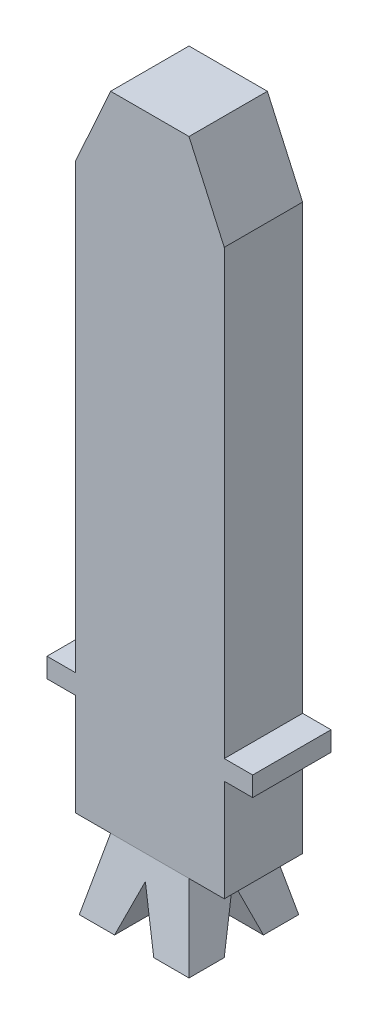
ISO-10303-21;
HEADER;
FILE_DESCRIPTION(('STEP AP214'),'2;1');
FILE_NAME('part.step','',(''),(''),'','','');
FILE_SCHEMA(('AUTOMOTIVE_DESIGN { 1 0 10303 214 1 1 1 1 }'));
ENDSEC;
DATA;
#1=APPLICATION_CONTEXT('core data for automotive mechanical design processes');
#2=APPLICATION_PROTOCOL_DEFINITION('international standard','automotive_design',2000,#1);
#3=PRODUCT_CONTEXT('',#1,'mechanical');
#4=PRODUCT('Part','Part','',(#3));
#5=PRODUCT_RELATED_PRODUCT_CATEGORY('part','',(#4));
#6=PRODUCT_DEFINITION_FORMATION('','',#4);
#7=PRODUCT_DEFINITION_CONTEXT('part definition',#1,'design');
#8=PRODUCT_DEFINITION('design','',#6,#7);
#9=PRODUCT_DEFINITION_SHAPE('','',#8);
#10=(LENGTH_UNIT() NAMED_UNIT(*) SI_UNIT(.MILLI.,.METRE.));
#11=(NAMED_UNIT(*) PLANE_ANGLE_UNIT() SI_UNIT($,.RADIAN.));
#12=(NAMED_UNIT(*) SI_UNIT($,.STERADIAN.) SOLID_ANGLE_UNIT());
#13=UNCERTAINTY_MEASURE_WITH_UNIT(LENGTH_MEASURE(1.E-05),#10,'distance_accuracy_value','');
#14=(GEOMETRIC_REPRESENTATION_CONTEXT(3) GLOBAL_UNCERTAINTY_ASSIGNED_CONTEXT((#13)) GLOBAL_UNIT_ASSIGNED_CONTEXT((#10,
#11,#12)) REPRESENTATION_CONTEXT('',''));
#15=CARTESIAN_POINT('',(0.,0.,0.));
#16=DIRECTION('',(0.,0.,1.));
#17=DIRECTION('',(1.,0.,0.));
#18=AXIS2_PLACEMENT_3D('',#15,#16,#17);
#19=CARTESIAN_POINT('',(0.,-4.9,0.));
#20=DIRECTION('',(0.,-1.,0.));
#21=DIRECTION('',(0.,0.,-1.));
#22=AXIS2_PLACEMENT_3D('',#19,#20,#21);
#23=PLANE('',#22);
#24=DIRECTION('',(-1.,0.,0.));
#25=VECTOR('',#24,1.);
#26=CARTESIAN_POINT('',(2.625,-4.9,1.5));
#27=LINE('',#26,#25);
#28=CARTESIAN_POINT('',(1.4,-4.9,1.5));
#29=VERTEX_POINT('',#28);
#30=CARTESIAN_POINT('',(0.5,-4.9,1.5));
#31=VERTEX_POINT('',#30);
#32=EDGE_CURVE('E478',#29,#31,#27,.T.);
#33=ORIENTED_EDGE('',*,*,#32,.F.);
#34=DIRECTION('',(0.,0.,1.));
#35=VECTOR('',#34,1.);
#36=CARTESIAN_POINT('',(1.4,-4.9,-0.4));
#37=LINE('',#36,#35);
#38=CARTESIAN_POINT('',(1.4,-4.9,2.4));
#39=VERTEX_POINT('',#38);
#40=EDGE_CURVE('E180',#29,#39,#37,.T.);
#41=ORIENTED_EDGE('',*,*,#40,.T.);
#42=DIRECTION('',(-1.,0.,0.));
#43=VECTOR('',#42,1.);
#44=CARTESIAN_POINT('',(1.4,-4.9,2.4));
#45=LINE('',#44,#43);
#46=CARTESIAN_POINT('',(0.500000000000001,-4.9,2.4));
#47=VERTEX_POINT('',#46);
#48=EDGE_CURVE('E355',#39,#47,#45,.T.);
#49=ORIENTED_EDGE('',*,*,#48,.T.);
#50=DIRECTION('',(0.,0.,1.));
#51=VECTOR('',#50,1.);
#52=CARTESIAN_POINT('',(0.500000000000001,-4.9,-0.4001));
#53=LINE('',#52,#51);
#54=EDGE_CURVE('E326',#31,#47,#53,.T.);
#55=ORIENTED_EDGE('',*,*,#54,.F.);
#56=EDGE_LOOP('',(#33,#41,#49,#55));
#57=FACE_BOUND('',#56,.T.);
#58=ADVANCED_FACE('F52',(#57),#23,.T.);
#59=CARTESIAN_POINT('',(-0.499999999999999,-4.9,1.5));
#60=VERTEX_POINT('',#59);
#61=CARTESIAN_POINT('',(-1.4,-4.9,1.5));
#62=VERTEX_POINT('',#61);
#63=EDGE_CURVE('E159',#60,#62,#27,.T.);
#64=ORIENTED_EDGE('',*,*,#63,.F.);
#65=DIRECTION('',(0.,0.,1.));
#66=VECTOR('',#65,1.);
#67=CARTESIAN_POINT('',(-0.499999999999999,-4.9,-0.4001));
#68=LINE('',#67,#66);
#69=CARTESIAN_POINT('',(-0.499999999999999,-4.9,2.4));
#70=VERTEX_POINT('',#69);
#71=EDGE_CURVE('E359',#60,#70,#68,.T.);
#72=ORIENTED_EDGE('',*,*,#71,.T.);
#73=CARTESIAN_POINT('',(-1.4,-4.9,2.4));
#74=VERTEX_POINT('',#73);
#75=EDGE_CURVE('E179',#70,#74,#45,.T.);
#76=ORIENTED_EDGE('',*,*,#75,.T.);
#77=DIRECTION('',(0.,0.,-1.));
#78=VECTOR('',#77,1.);
#79=CARTESIAN_POINT('',(-1.4,-4.9,-0.4));
#80=LINE('',#79,#78);
#81=EDGE_CURVE('E389',#74,#62,#80,.T.);
#82=ORIENTED_EDGE('',*,*,#81,.T.);
#83=EDGE_LOOP('',(#64,#72,#76,#82));
#84=FACE_BOUND('',#83,.T.);
#85=ADVANCED_FACE('F518',(#84),#23,.T.);
#86=CARTESIAN_POINT('',(0.500000000000001,-4.9,-0.4001));
#87=DIRECTION('',(0.932267960991806,0.361768501818747,0.));
#88=DIRECTION('',(-0.361768501818747,0.932267960991806,0.));
#89=AXIS2_PLACEMENT_3D('',#86,#87,#88);
#90=PLANE('',#89);
#91=DIRECTION('',(0.,0.,1.));
#92=VECTOR('',#91,1.);
#93=CARTESIAN_POINT('',(0.,-3.61151308598601,-0.4001));
#94=LINE('',#93,#92);
#95=CARTESIAN_POINT('',(0.,-3.611513085986,0.999999999999999));
#96=VERTEX_POINT('',#95);
#97=CARTESIAN_POINT('',(0.,-3.611513085986,2.11366957466356));
#98=VERTEX_POINT('',#97);
#99=EDGE_CURVE('E472',#96,#98,#94,.T.);
#100=ORIENTED_EDGE('',*,*,#99,.F.);
#101=DIRECTION('',(0.340191275432694,-0.876664013313512,0.340191275432694));
#102=VECTOR('',#101,1.);
#103=CARTESIAN_POINT('',(0.280101229616619,-4.33332662390649,1.28010122961662));
#104=LINE('',#103,#102);
#105=EDGE_CURVE('E171',#96,#31,#104,.T.);
#106=ORIENTED_EDGE('',*,*,#105,.T.);
#107=ORIENTED_EDGE('',*,*,#54,.T.);
#108=DIRECTION('',(0.354246297399246,-0.912883437073675,0.202862986016372));
#109=VECTOR('',#108,1.);
#110=CARTESIAN_POINT('',(-1.3198068575803,-0.210405355949719,1.35786785687772));
#111=LINE('',#110,#109);
#112=EDGE_CURVE('E319',#98,#47,#111,.T.);
#113=ORIENTED_EDGE('',*,*,#112,.F.);
#114=EDGE_LOOP('',(#100,#106,#107,#113));
#115=FACE_BOUND('',#114,.T.);
#116=ADVANCED_FACE('F475',(#115),#90,.F.);
#117=CARTESIAN_POINT('',(0.,-3.61151308598601,-0.4001));
#118=DIRECTION('',(-0.932267960991806,0.361768501818746,0.));
#119=DIRECTION('',(-0.361768501818746,-0.932267960991806,0.));
#120=AXIS2_PLACEMENT_3D('',#117,#118,#119);
#121=PLANE('',#120);
#122=ORIENTED_EDGE('',*,*,#71,.F.);
#123=DIRECTION('',(0.340191275432693,0.876664013313513,-0.340191275432694));
#124=VECTOR('',#123,1.);
#125=CARTESIAN_POINT('',(0.16203371844312,-3.19395643430003,0.837966281556879));
#126=LINE('',#125,#124);
#127=EDGE_CURVE('E13',#60,#96,#126,.T.);
#128=ORIENTED_EDGE('',*,*,#127,.T.);
#129=ORIENTED_EDGE('',*,*,#99,.T.);
#130=DIRECTION('',(0.354246297399245,0.912883437073675,-0.202862986016372));
#131=VECTOR('',#130,1.);
#132=CARTESIAN_POINT('',(1.3198068575803,-0.210405355949717,1.35786785687771));
#133=LINE('',#132,#131);
#134=EDGE_CURVE('E322',#70,#98,#133,.T.);
#135=ORIENTED_EDGE('',*,*,#134,.F.);
#136=EDGE_LOOP('',(#122,#128,#129,#135));
#137=FACE_BOUND('',#136,.T.);
#138=ADVANCED_FACE('F470',(#137),#121,.F.);
#139=DIRECTION('',(-1.,0.,0.));
#140=VECTOR('',#139,1.);
#141=CARTESIAN_POINT('',(2.625,-4.9,0.499999999999999));
#142=LINE('',#141,#140);
#143=CARTESIAN_POINT('',(1.4,-4.9,0.499999999999999));
#144=VERTEX_POINT('',#143);
#145=CARTESIAN_POINT('',(0.5,-4.9,0.499999999999999));
#146=VERTEX_POINT('',#145);
#147=EDGE_CURVE('E148',#144,#146,#142,.T.);
#148=ORIENTED_EDGE('',*,*,#147,.T.);
#149=CARTESIAN_POINT('',(0.500000000000001,-4.9,-0.4));
#150=VERTEX_POINT('',#149);
#151=EDGE_CURVE('E323',#150,#146,#53,.T.);
#152=ORIENTED_EDGE('',*,*,#151,.F.);
#153=DIRECTION('',(1.,0.,0.));
#154=VECTOR('',#153,1.);
#155=CARTESIAN_POINT('',(1.4,-4.9,-0.4));
#156=LINE('',#155,#154);
#157=CARTESIAN_POINT('',(1.4,-4.9,-0.4));
#158=VERTEX_POINT('',#157);
#159=EDGE_CURVE('E177',#150,#158,#156,.T.);
#160=ORIENTED_EDGE('',*,*,#159,.T.);
#161=EDGE_CURVE('E167',#158,#144,#37,.T.);
#162=ORIENTED_EDGE('',*,*,#161,.T.);
#163=EDGE_LOOP('',(#148,#152,#160,#162));
#164=FACE_BOUND('',#163,.T.);
#165=ADVANCED_FACE('F175',(#164),#23,.T.);
#166=CARTESIAN_POINT('',(-0.499999999999999,-4.9,0.499999999999999));
#167=VERTEX_POINT('',#166);
#168=CARTESIAN_POINT('',(-1.4,-4.9,0.499999999999999));
#169=VERTEX_POINT('',#168);
#170=EDGE_CURVE('E71',#167,#169,#142,.T.);
#171=ORIENTED_EDGE('',*,*,#170,.T.);
#172=CARTESIAN_POINT('',(-1.4,-4.9,-0.4));
#173=VERTEX_POINT('',#172);
#174=EDGE_CURVE('E57',#169,#173,#80,.T.);
#175=ORIENTED_EDGE('',*,*,#174,.T.);
#176=CARTESIAN_POINT('',(-0.499999999999999,-4.9,-0.4));
#177=VERTEX_POINT('',#176);
#178=EDGE_CURVE('E249',#173,#177,#156,.T.);
#179=ORIENTED_EDGE('',*,*,#178,.T.);
#180=EDGE_CURVE('E78',#177,#167,#68,.T.);
#181=ORIENTED_EDGE('',*,*,#180,.T.);
#182=EDGE_LOOP('',(#171,#175,#179,#181));
#183=FACE_BOUND('',#182,.T.);
#184=ADVANCED_FACE('F54',(#183),#23,.T.);
#185=CARTESIAN_POINT('',(0.,-3.1,0.));
#186=DIRECTION('',(0.,-1.,0.));
#187=DIRECTION('',(0.,0.,-1.));
#188=AXIS2_PLACEMENT_3D('',#185,#186,#187);
#189=PLANE('',#188);
#190=DIRECTION('',(0.,0.,-1.));
#191=VECTOR('',#190,1.);
#192=CARTESIAN_POINT('',(-1.,-3.1,2.));
#193=LINE('',#192,#191);
#194=CARTESIAN_POINT('',(-1.,-3.1,2.));
#195=VERTEX_POINT('',#194);
#196=CARTESIAN_POINT('',(-1.,-3.1,0.));
#197=VERTEX_POINT('',#196);
#198=EDGE_CURVE('E297',#195,#197,#193,.T.);
#199=ORIENTED_EDGE('',*,*,#198,.F.);
#200=DIRECTION('',(-1.,0.,0.));
#201=VECTOR('',#200,1.);
#202=CARTESIAN_POINT('',(-1.,-3.1,2.));
#203=LINE('',#202,#201);
#204=CARTESIAN_POINT('',(1.,-3.1,2.));
#205=VERTEX_POINT('',#204);
#206=EDGE_CURVE('E302',#205,#195,#203,.T.);
#207=ORIENTED_EDGE('',*,*,#206,.F.);
#208=DIRECTION('',(0.,0.,1.));
#209=VECTOR('',#208,1.);
#210=CARTESIAN_POINT('',(1.,-3.1,2.));
#211=LINE('',#210,#209);
#212=CARTESIAN_POINT('',(1.,-3.1,0.));
#213=VERTEX_POINT('',#212);
#214=EDGE_CURVE('E405',#213,#205,#211,.T.);
#215=ORIENTED_EDGE('',*,*,#214,.F.);
#216=DIRECTION('',(1.,0.,0.));
#217=VECTOR('',#216,1.);
#218=CARTESIAN_POINT('',(-1.,-3.1,0.));
#219=LINE('',#218,#217);
#220=EDGE_CURVE('E437',#197,#213,#219,.T.);
#221=ORIENTED_EDGE('',*,*,#220,.F.);
#222=EDGE_LOOP('',(#199,#207,#215,#221));
#223=FACE_BOUND('',#222,.T.);
#224=ADVANCED_FACE('F415',(#223),#189,.F.);
#225=CARTESIAN_POINT('',(0.,0.277647058823529,1.24941176470588));
#226=DIRECTION('',(0.,-0.216930457818656,-0.976187060183953));
#227=DIRECTION('',(0.,0.976187060183953,-0.216930457818656));
#228=AXIS2_PLACEMENT_3D('',#225,#226,#227);
#229=PLANE('',#228);
#230=ORIENTED_EDGE('',*,*,#134,.T.);
#231=ORIENTED_EDGE('',*,*,#112,.T.);
#232=ORIENTED_EDGE('',*,*,#48,.F.);
#233=DIRECTION('',(0.211999576001272,-0.953998092005724,0.211999576001272));
#234=VECTOR('',#233,1.);
#235=CARTESIAN_POINT('',(1.,-3.1,2.));
#236=LINE('',#235,#234);
#237=EDGE_CURVE('E279',#205,#39,#236,.T.);
#238=ORIENTED_EDGE('',*,*,#237,.F.);
#239=ORIENTED_EDGE('',*,*,#206,.T.);
#240=DIRECTION('',(-0.211999576001272,-0.953998092005724,0.211999576001272));
#241=VECTOR('',#240,1.);
#242=CARTESIAN_POINT('',(-1.,-3.1,2.));
#243=LINE('',#242,#241);
#244=EDGE_CURVE('E283',#195,#74,#243,.T.);
#245=ORIENTED_EDGE('',*,*,#244,.T.);
#246=ORIENTED_EDGE('',*,*,#75,.F.);
#247=EDGE_LOOP('',(#230,#231,#232,#238,#239,#245,#246));
#248=FACE_BOUND('',#247,.T.);
#249=ADVANCED_FACE('F228',(#248),#229,.F.);
#250=CARTESIAN_POINT('',(0.296470588235295,0.0658823529411766,0.));
#251=DIRECTION('',(-0.976187060183953,-0.216930457818656,0.));
#252=DIRECTION('',(0.216930457818656,-0.976187060183953,0.));
#253=AXIS2_PLACEMENT_3D('',#250,#251,#252);
#254=PLANE('',#253);
#255=ORIENTED_EDGE('',*,*,#40,.F.);
#256=DIRECTION('',(-0.202862986016372,0.912883437073675,-0.354246297399246));
#257=VECTOR('',#256,1.);
#258=CARTESIAN_POINT('',(0.32715778629754,-0.0722100383389264,-0.373433835125718));
#259=LINE('',#258,#257);
#260=CARTESIAN_POINT('',(1.11366957466356,-3.611513085986,0.999999999999998));
#261=VERTEX_POINT('',#260);
#262=EDGE_CURVE('E170',#29,#261,#259,.T.);
#263=ORIENTED_EDGE('',*,*,#262,.T.);
#264=DIRECTION('',(0.202862986016372,-0.912883437073675,-0.354246297399245));
#265=VECTOR('',#264,1.);
#266=CARTESIAN_POINT('',(0.470884709648849,-0.718981193419817,2.12245295668356));
#267=LINE('',#266,#265);
#268=EDGE_CURVE('E151',#261,#144,#267,.T.);
#269=ORIENTED_EDGE('',*,*,#268,.T.);
#270=ORIENTED_EDGE('',*,*,#161,.F.);
#271=DIRECTION('',(0.211999576001272,-0.953998092005724,-0.211999576001272));
#272=VECTOR('',#271,1.);
#273=CARTESIAN_POINT('',(1.,-3.1,0.));
#274=LINE('',#273,#272);
#275=EDGE_CURVE('E270',#213,#158,#274,.T.);
#276=ORIENTED_EDGE('',*,*,#275,.F.);
#277=ORIENTED_EDGE('',*,*,#214,.T.);
#278=ORIENTED_EDGE('',*,*,#237,.T.);
#279=EDGE_LOOP('',(#255,#263,#269,#270,#276,#277,#278));
#280=FACE_BOUND('',#279,.T.);
#281=ADVANCED_FACE('F165',(#280),#254,.F.);
#282=CARTESIAN_POINT('',(-0.296470588235294,0.0658823529411765,0.));
#283=DIRECTION('',(0.976187060183953,-0.216930457818656,0.));
#284=DIRECTION('',(0.216930457818656,0.976187060183953,0.));
#285=AXIS2_PLACEMENT_3D('',#282,#283,#284);
#286=PLANE('',#285);
#287=DIRECTION('',(0.202862986016372,0.912883437073675,0.354246297399245));
#288=VECTOR('',#287,1.);
#289=CARTESIAN_POINT('',(-0.470884709648848,-0.718981193419817,2.12245295668357));
#290=LINE('',#289,#288);
#291=CARTESIAN_POINT('',(-1.11366957466356,-3.611513085986,0.999999999999999));
#292=VERTEX_POINT('',#291);
#293=EDGE_CURVE('E172',#169,#292,#290,.T.);
#294=ORIENTED_EDGE('',*,*,#293,.T.);
#295=DIRECTION('',(-0.202862986016372,-0.912883437073675,0.354246297399246));
#296=VECTOR('',#295,1.);
#297=CARTESIAN_POINT('',(-0.327157786297539,-0.0722100383389265,-0.373433835125718));
#298=LINE('',#297,#296);
#299=EDGE_CURVE('E500',#292,#62,#298,.T.);
#300=ORIENTED_EDGE('',*,*,#299,.T.);
#301=ORIENTED_EDGE('',*,*,#81,.F.);
#302=ORIENTED_EDGE('',*,*,#244,.F.);
#303=ORIENTED_EDGE('',*,*,#198,.T.);
#304=DIRECTION('',(-0.211999576001272,-0.953998092005724,-0.211999576001272));
#305=VECTOR('',#304,1.);
#306=CARTESIAN_POINT('',(-1.,-3.1,0.));
#307=LINE('',#306,#305);
#308=EDGE_CURVE('E276',#197,#173,#307,.T.);
#309=ORIENTED_EDGE('',*,*,#308,.T.);
#310=ORIENTED_EDGE('',*,*,#174,.F.);
#311=EDGE_LOOP('',(#294,#300,#301,#302,#303,#309,#310));
#312=FACE_BOUND('',#311,.T.);
#313=ADVANCED_FACE('F227',(#312),#286,.F.);
#314=CARTESIAN_POINT('',(0.,-0.145882352941177,0.656470588235294));
#315=DIRECTION('',(0.,-0.216930457818656,0.976187060183953));
#316=DIRECTION('',(0.,-0.976187060183953,-0.216930457818656));
#317=AXIS2_PLACEMENT_3D('',#314,#315,#316);
#318=PLANE('',#317);
#319=ORIENTED_EDGE('',*,*,#159,.F.);
#320=DIRECTION('',(-0.354246297399246,0.912883437073675,0.202862986016372));
#321=VECTOR('',#320,1.);
#322=CARTESIAN_POINT('',(-1.17607993422899,-0.580785875809028,0.559825360931327));
#323=LINE('',#322,#321);
#324=CARTESIAN_POINT('',(0.,-3.611513085986,-0.113669574663557));
#325=VERTEX_POINT('',#324);
#326=EDGE_CURVE('E361',#150,#325,#323,.T.);
#327=ORIENTED_EDGE('',*,*,#326,.T.);
#328=DIRECTION('',(-0.354246297399245,-0.912883437073675,-0.202862986016372));
#329=VECTOR('',#328,1.);
#330=CARTESIAN_POINT('',(1.17607993422899,-0.580785875809026,0.559825360931328));
#331=LINE('',#330,#329);
#332=EDGE_CURVE('E364',#325,#177,#331,.T.);
#333=ORIENTED_EDGE('',*,*,#332,.T.);
#334=ORIENTED_EDGE('',*,*,#178,.F.);
#335=ORIENTED_EDGE('',*,*,#308,.F.);
#336=ORIENTED_EDGE('',*,*,#220,.T.);
#337=ORIENTED_EDGE('',*,*,#275,.T.);
#338=EDGE_LOOP('',(#319,#327,#333,#334,#335,#336,#337));
#339=FACE_BOUND('',#338,.T.);
#340=ADVANCED_FACE('F253',(#339),#318,.F.);
#341=ORIENTED_EDGE('',*,*,#151,.T.);
#342=DIRECTION('',(-0.340191275432694,0.876664013313513,0.340191275432693));
#343=VECTOR('',#342,1.);
#344=CARTESIAN_POINT('',(0.604168666502859,-5.16843992727844,0.395831333497141));
#345=LINE('',#344,#343);
#346=EDGE_CURVE('E154',#146,#96,#345,.T.);
#347=ORIENTED_EDGE('',*,*,#346,.T.);
#348=EDGE_CURVE('E360',#325,#96,#94,.T.);
#349=ORIENTED_EDGE('',*,*,#348,.F.);
#350=ORIENTED_EDGE('',*,*,#326,.F.);
#351=EDGE_LOOP('',(#341,#347,#349,#350));
#352=FACE_BOUND('',#351,.T.);
#353=ADVANCED_FACE('F261',(#352),#90,.F.);
#354=ORIENTED_EDGE('',*,*,#348,.T.);
#355=DIRECTION('',(-0.340191275432693,-0.876664013313513,-0.340191275432693));
#356=VECTOR('',#355,1.);
#357=CARTESIAN_POINT('',(-0.16203371844312,-4.02906973767198,0.837966281556879));
#358=LINE('',#357,#356);
#359=EDGE_CURVE('E63',#96,#167,#358,.T.);
#360=ORIENTED_EDGE('',*,*,#359,.T.);
#361=ORIENTED_EDGE('',*,*,#180,.F.);
#362=ORIENTED_EDGE('',*,*,#332,.F.);
#363=EDGE_LOOP('',(#354,#360,#361,#362));
#364=FACE_BOUND('',#363,.T.);
#365=ADVANCED_FACE('F529',(#364),#121,.F.);
#366=CARTESIAN_POINT('',(2.625,-3.611513085986,0.999999999999999));
#367=DIRECTION('',(0.,0.361768501818746,-0.932267960991806));
#368=DIRECTION('',(0.,0.932267960991806,0.361768501818746));
#369=AXIS2_PLACEMENT_3D('',#366,#367,#368);
#370=PLANE('',#369);
#371=ORIENTED_EDGE('',*,*,#170,.F.);
#372=ORIENTED_EDGE('',*,*,#359,.F.);
#373=DIRECTION('',(-1.,0.,0.));
#374=VECTOR('',#373,1.);
#375=CARTESIAN_POINT('',(2.625,-3.611513085986,0.999999999999999));
#376=LINE('',#375,#374);
#377=EDGE_CURVE('E492',#96,#292,#376,.T.);
#378=ORIENTED_EDGE('',*,*,#377,.T.);
#379=ORIENTED_EDGE('',*,*,#293,.F.);
#380=EDGE_LOOP('',(#371,#372,#378,#379));
#381=FACE_BOUND('',#380,.T.);
#382=ADVANCED_FACE('F502',(#381),#370,.F.);
#383=CARTESIAN_POINT('',(2.625,-4.9,1.5));
#384=DIRECTION('',(0.,0.361768501818747,0.932267960991806));
#385=DIRECTION('',(0.,-0.932267960991806,0.361768501818747));
#386=AXIS2_PLACEMENT_3D('',#383,#384,#385);
#387=PLANE('',#386);
#388=ORIENTED_EDGE('',*,*,#377,.F.);
#389=ORIENTED_EDGE('',*,*,#127,.F.);
#390=ORIENTED_EDGE('',*,*,#63,.T.);
#391=ORIENTED_EDGE('',*,*,#299,.F.);
#392=EDGE_LOOP('',(#388,#389,#390,#391));
#393=FACE_BOUND('',#392,.T.);
#394=ADVANCED_FACE('F510',(#393),#387,.F.);
#395=ORIENTED_EDGE('',*,*,#32,.T.);
#396=ORIENTED_EDGE('',*,*,#105,.F.);
#397=EDGE_CURVE('E495',#261,#96,#376,.T.);
#398=ORIENTED_EDGE('',*,*,#397,.F.);
#399=ORIENTED_EDGE('',*,*,#262,.F.);
#400=EDGE_LOOP('',(#395,#396,#398,#399));
#401=FACE_BOUND('',#400,.T.);
#402=ADVANCED_FACE('F505',(#401),#387,.F.);
#403=ORIENTED_EDGE('',*,*,#397,.T.);
#404=ORIENTED_EDGE('',*,*,#346,.F.);
#405=ORIENTED_EDGE('',*,*,#147,.F.);
#406=ORIENTED_EDGE('',*,*,#268,.F.);
#407=EDGE_LOOP('',(#403,#404,#405,#406));
#408=FACE_BOUND('',#407,.T.);
#409=ADVANCED_FACE('F150',(#408),#370,.F.);
#410=CLOSED_SHELL('',(#58,#85,#116,#138,#165,#184,#224,#249,#281,#313,#340,#353,#365,#382,#394,
#402,#409));
#411=MANIFOLD_SOLID_BREP('B2',#410);
#412=CARTESIAN_POINT('',(-1.9,11.3,2.));
#413=DIRECTION('',(0.911921505175107,-0.410364677328798,0.));
#414=DIRECTION('',(0.410364677328798,0.911921505175107,0.));
#415=AXIS2_PLACEMENT_3D('',#412,#413,#414);
#416=PLANE('',#415);
#417=DIRECTION('',(-0.410364677328798,-0.911921505175106,0.));
#418=VECTOR('',#417,1.);
#419=CARTESIAN_POINT('',(-1.9,11.3,0.));
#420=LINE('',#419,#418);
#421=CARTESIAN_POINT('',(-1.,13.3,0.));
#422=VERTEX_POINT('',#421);
#423=CARTESIAN_POINT('',(-1.9,11.3,0.));
#424=VERTEX_POINT('',#423);
#425=EDGE_CURVE('E802',#422,#424,#420,.T.);
#426=ORIENTED_EDGE('',*,*,#425,.T.);
#427=DIRECTION('',(0.,0.,-1.));
#428=VECTOR('',#427,1.);
#429=CARTESIAN_POINT('',(-1.9,11.3,2.));
#430=LINE('',#429,#428);
#431=CARTESIAN_POINT('',(-1.9,11.3,2.));
#432=VERTEX_POINT('',#431);
#433=EDGE_CURVE('E50',#432,#424,#430,.T.);
#434=ORIENTED_EDGE('',*,*,#433,.F.);
#435=DIRECTION('',(-0.410364677328798,-0.911921505175106,0.));
#436=VECTOR('',#435,1.);
#437=CARTESIAN_POINT('',(-1.9,11.3,2.));
#438=LINE('',#437,#436);
#439=CARTESIAN_POINT('',(-1.,13.3,2.));
#440=VERTEX_POINT('',#439);
#441=EDGE_CURVE('E828',#440,#432,#438,.T.);
#442=ORIENTED_EDGE('',*,*,#441,.F.);
#443=DIRECTION('',(0.,0.,-1.));
#444=VECTOR('',#443,1.);
#445=CARTESIAN_POINT('',(-1.,13.3,2.));
#446=LINE('',#445,#444);
#447=EDGE_CURVE('E798',#440,#422,#446,.T.);
#448=ORIENTED_EDGE('',*,*,#447,.T.);
#449=EDGE_LOOP('',(#426,#434,#442,#448));
#450=FACE_BOUND('',#449,.T.);
#451=ADVANCED_FACE('F670',(#450),#416,.F.);
#452=CARTESIAN_POINT('',(-1.9,11.3,2.));
#453=DIRECTION('',(1.,0.,0.));
#454=DIRECTION('',(0.,1.,0.));
#455=AXIS2_PLACEMENT_3D('',#452,#453,#454);
#456=PLANE('',#455);
#457=DIRECTION('',(0.,-1.,0.));
#458=VECTOR('',#457,1.);
#459=CARTESIAN_POINT('',(-1.9,11.3,0.));
#460=LINE('',#459,#458);
#461=CARTESIAN_POINT('',(-1.9,0.,0.));
#462=VERTEX_POINT('',#461);
#463=EDGE_CURVE('E805',#424,#462,#460,.T.);
#464=ORIENTED_EDGE('',*,*,#463,.T.);
#465=DIRECTION('',(0.,0.,-1.));
#466=VECTOR('',#465,1.);
#467=CARTESIAN_POINT('',(-1.9,0.,2.));
#468=LINE('',#467,#466);
#469=CARTESIAN_POINT('',(-1.9,0.,2.));
#470=VERTEX_POINT('',#469);
#471=EDGE_CURVE('E678',#470,#462,#468,.T.);
#472=ORIENTED_EDGE('',*,*,#471,.F.);
#473=DIRECTION('',(0.,-1.,0.));
#474=VECTOR('',#473,1.);
#475=CARTESIAN_POINT('',(-1.9,11.3,2.));
#476=LINE('',#475,#474);
#477=EDGE_CURVE('E747',#432,#470,#476,.T.);
#478=ORIENTED_EDGE('',*,*,#477,.F.);
#479=ORIENTED_EDGE('',*,*,#433,.T.);
#480=EDGE_LOOP('',(#464,#472,#478,#479));
#481=FACE_BOUND('',#480,.T.);
#482=ADVANCED_FACE('F916',(#481),#456,.F.);
#483=CARTESIAN_POINT('',(-2.625,0.,2.));
#484=DIRECTION('',(0.,-1.,0.));
#485=DIRECTION('',(1.,0.,0.));
#486=AXIS2_PLACEMENT_3D('',#483,#484,#485);
#487=PLANE('',#486);
#488=DIRECTION('',(-1.,0.,0.));
#489=VECTOR('',#488,1.);
#490=CARTESIAN_POINT('',(-2.625,0.,0.));
#491=LINE('',#490,#489);
#492=CARTESIAN_POINT('',(-2.625,0.,0.));
#493=VERTEX_POINT('',#492);
#494=EDGE_CURVE('E807',#462,#493,#491,.T.);
#495=ORIENTED_EDGE('',*,*,#494,.T.);
#496=DIRECTION('',(0.,0.,-1.));
#497=VECTOR('',#496,1.);
#498=CARTESIAN_POINT('',(-2.625,0.,2.));
#499=LINE('',#498,#497);
#500=CARTESIAN_POINT('',(-2.625,0.,2.));
#501=VERTEX_POINT('',#500);
#502=EDGE_CURVE('E853',#501,#493,#499,.T.);
#503=ORIENTED_EDGE('',*,*,#502,.F.);
#504=DIRECTION('',(-1.,0.,0.));
#505=VECTOR('',#504,1.);
#506=CARTESIAN_POINT('',(-2.625,0.,2.));
#507=LINE('',#506,#505);
#508=EDGE_CURVE('E861',#470,#501,#507,.T.);
#509=ORIENTED_EDGE('',*,*,#508,.F.);
#510=ORIENTED_EDGE('',*,*,#471,.T.);
#511=EDGE_LOOP('',(#495,#503,#509,#510));
#512=FACE_BOUND('',#511,.T.);
#513=ADVANCED_FACE('F859',(#512),#487,.F.);
#514=CARTESIAN_POINT('',(-2.625,0.,2.));
#515=DIRECTION('',(1.,0.,0.));
#516=DIRECTION('',(0.,0.,-1.));
#517=AXIS2_PLACEMENT_3D('',#514,#515,#516);
#518=PLANE('',#517);
#519=DIRECTION('',(0.,-1.,0.));
#520=VECTOR('',#519,1.);
#521=CARTESIAN_POINT('',(-2.625,0.,0.));
#522=LINE('',#521,#520);
#523=CARTESIAN_POINT('',(-2.625,-0.5,0.));
#524=VERTEX_POINT('',#523);
#525=EDGE_CURVE('E809',#493,#524,#522,.T.);
#526=ORIENTED_EDGE('',*,*,#525,.T.);
#527=DIRECTION('',(0.,0.,-1.));
#528=VECTOR('',#527,1.);
#529=CARTESIAN_POINT('',(-2.625,-0.5,2.));
#530=LINE('',#529,#528);
#531=CARTESIAN_POINT('',(-2.625,-0.5,2.));
#532=VERTEX_POINT('',#531);
#533=EDGE_CURVE('E850',#532,#524,#530,.T.);
#534=ORIENTED_EDGE('',*,*,#533,.F.);
#535=DIRECTION('',(0.,-1.,0.));
#536=VECTOR('',#535,1.);
#537=CARTESIAN_POINT('',(-2.625,0.,2.));
#538=LINE('',#537,#536);
#539=EDGE_CURVE('E879',#501,#532,#538,.T.);
#540=ORIENTED_EDGE('',*,*,#539,.F.);
#541=ORIENTED_EDGE('',*,*,#502,.T.);
#542=EDGE_LOOP('',(#526,#534,#540,#541));
#543=FACE_BOUND('',#542,.T.);
#544=ADVANCED_FACE('F870',(#543),#518,.F.);
#545=CARTESIAN_POINT('',(-2.625,-0.5,2.));
#546=DIRECTION('',(0.,1.,0.));
#547=DIRECTION('',(0.,0.,1.));
#548=AXIS2_PLACEMENT_3D('',#545,#546,#547);
#549=PLANE('',#548);
#550=DIRECTION('',(1.,0.,0.));
#551=VECTOR('',#550,1.);
#552=CARTESIAN_POINT('',(-2.625,-0.5,0.));
#553=LINE('',#552,#551);
#554=CARTESIAN_POINT('',(-1.9,-0.5,0.));
#555=VERTEX_POINT('',#554);
#556=EDGE_CURVE('E811',#524,#555,#553,.T.);
#557=ORIENTED_EDGE('',*,*,#556,.T.);
#558=DIRECTION('',(0.,0.,-1.));
#559=VECTOR('',#558,1.);
#560=CARTESIAN_POINT('',(-1.9,-0.5,2.));
#561=LINE('',#560,#559);
#562=CARTESIAN_POINT('',(-1.9,-0.5,2.));
#563=VERTEX_POINT('',#562);
#564=EDGE_CURVE('E847',#563,#555,#561,.T.);
#565=ORIENTED_EDGE('',*,*,#564,.F.);
#566=DIRECTION('',(1.,0.,0.));
#567=VECTOR('',#566,1.);
#568=CARTESIAN_POINT('',(-2.625,-0.5,2.));
#569=LINE('',#568,#567);
#570=EDGE_CURVE('E876',#532,#563,#569,.T.);
#571=ORIENTED_EDGE('',*,*,#570,.F.);
#572=ORIENTED_EDGE('',*,*,#533,.T.);
#573=EDGE_LOOP('',(#557,#565,#571,#572));
#574=FACE_BOUND('',#573,.T.);
#575=ADVANCED_FACE('F874',(#574),#549,.F.);
#576=CARTESIAN_POINT('',(-1.9,-0.5,2.));
#577=DIRECTION('',(1.,0.,0.));
#578=DIRECTION('',(0.,1.,0.));
#579=AXIS2_PLACEMENT_3D('',#576,#577,#578);
#580=PLANE('',#579);
#581=DIRECTION('',(0.,-1.,0.));
#582=VECTOR('',#581,1.);
#583=CARTESIAN_POINT('',(-1.9,-0.5,0.));
#584=LINE('',#583,#582);
#585=CARTESIAN_POINT('',(-1.9,-3.1,0.));
#586=VERTEX_POINT('',#585);
#587=EDGE_CURVE('E813',#555,#586,#584,.T.);
#588=ORIENTED_EDGE('',*,*,#587,.T.);
#589=DIRECTION('',(0.,0.,-1.));
#590=VECTOR('',#589,1.);
#591=CARTESIAN_POINT('',(-1.9,-3.1,2.));
#592=LINE('',#591,#590);
#593=CARTESIAN_POINT('',(-1.9,-3.1,2.));
#594=VERTEX_POINT('',#593);
#595=EDGE_CURVE('E844',#594,#586,#592,.T.);
#596=ORIENTED_EDGE('',*,*,#595,.F.);
#597=DIRECTION('',(0.,-1.,0.));
#598=VECTOR('',#597,1.);
#599=CARTESIAN_POINT('',(-1.9,-0.5,2.));
#600=LINE('',#599,#598);
#601=EDGE_CURVE('E878',#563,#594,#600,.T.);
#602=ORIENTED_EDGE('',*,*,#601,.F.);
#603=ORIENTED_EDGE('',*,*,#564,.T.);
#604=EDGE_LOOP('',(#588,#596,#602,#603));
#605=FACE_BOUND('',#604,.T.);
#606=ADVANCED_FACE('F929',(#605),#580,.F.);
#607=CARTESIAN_POINT('',(-1.9,-3.1,2.));
#608=DIRECTION('',(0.,1.,0.));
#609=DIRECTION('',(0.,0.,1.));
#610=AXIS2_PLACEMENT_3D('',#607,#608,#609);
#611=PLANE('',#610);
#612=DIRECTION('',(1.,0.,0.));
#613=VECTOR('',#612,1.);
#614=CARTESIAN_POINT('',(-1.9,-3.1,0.));
#615=LINE('',#614,#613);
#616=CARTESIAN_POINT('',(1.9,-3.1,0.));
#617=VERTEX_POINT('',#616);
#618=EDGE_CURVE('E815',#586,#617,#615,.T.);
#619=ORIENTED_EDGE('',*,*,#618,.T.);
#620=DIRECTION('',(0.,0.,-1.));
#621=VECTOR('',#620,1.);
#622=CARTESIAN_POINT('',(1.9,-3.1,2.));
#623=LINE('',#622,#621);
#624=CARTESIAN_POINT('',(1.9,-3.1,2.));
#625=VERTEX_POINT('',#624);
#626=EDGE_CURVE('E841',#625,#617,#623,.T.);
#627=ORIENTED_EDGE('',*,*,#626,.F.);
#628=DIRECTION('',(1.,0.,0.));
#629=VECTOR('',#628,1.);
#630=CARTESIAN_POINT('',(-1.9,-3.1,2.));
#631=LINE('',#630,#629);
#632=EDGE_CURVE('E881',#594,#625,#631,.T.);
#633=ORIENTED_EDGE('',*,*,#632,.F.);
#634=ORIENTED_EDGE('',*,*,#595,.T.);
#635=EDGE_LOOP('',(#619,#627,#633,#634));
#636=FACE_BOUND('',#635,.T.);
#637=ADVANCED_FACE('F932',(#636),#611,.F.);
#638=CARTESIAN_POINT('',(1.9,-0.5,2.));
#639=DIRECTION('',(-1.,0.,0.));
#640=DIRECTION('',(0.,-1.,0.));
#641=AXIS2_PLACEMENT_3D('',#638,#639,#640);
#642=PLANE('',#641);
#643=DIRECTION('',(0.,1.,0.));
#644=VECTOR('',#643,1.);
#645=CARTESIAN_POINT('',(1.9,-0.5,0.));
#646=LINE('',#645,#644);
#647=CARTESIAN_POINT('',(1.9,-0.5,0.));
#648=VERTEX_POINT('',#647);
#649=EDGE_CURVE('E817',#617,#648,#646,.T.);
#650=ORIENTED_EDGE('',*,*,#649,.T.);
#651=DIRECTION('',(0.,0.,-1.));
#652=VECTOR('',#651,1.);
#653=CARTESIAN_POINT('',(1.9,-0.5,2.));
#654=LINE('',#653,#652);
#655=CARTESIAN_POINT('',(1.9,-0.5,2.));
#656=VERTEX_POINT('',#655);
#657=EDGE_CURVE('E838',#656,#648,#654,.T.);
#658=ORIENTED_EDGE('',*,*,#657,.F.);
#659=DIRECTION('',(0.,1.,0.));
#660=VECTOR('',#659,1.);
#661=CARTESIAN_POINT('',(1.9,-0.5,2.));
#662=LINE('',#661,#660);
#663=EDGE_CURVE('E887',#625,#656,#662,.T.);
#664=ORIENTED_EDGE('',*,*,#663,.F.);
#665=ORIENTED_EDGE('',*,*,#626,.T.);
#666=EDGE_LOOP('',(#650,#658,#664,#665));
#667=FACE_BOUND('',#666,.T.);
#668=ADVANCED_FACE('F936',(#667),#642,.F.);
#669=CARTESIAN_POINT('',(1.9,-0.5,2.));
#670=DIRECTION('',(0.,1.,0.));
#671=DIRECTION('',(0.,0.,1.));
#672=AXIS2_PLACEMENT_3D('',#669,#670,#671);
#673=PLANE('',#672);
#674=DIRECTION('',(1.,0.,0.));
#675=VECTOR('',#674,1.);
#676=CARTESIAN_POINT('',(1.9,-0.5,0.));
#677=LINE('',#676,#675);
#678=CARTESIAN_POINT('',(2.625,-0.5,0.));
#679=VERTEX_POINT('',#678);
#680=EDGE_CURVE('E819',#648,#679,#677,.T.);
#681=ORIENTED_EDGE('',*,*,#680,.T.);
#682=DIRECTION('',(0.,0.,-1.));
#683=VECTOR('',#682,1.);
#684=CARTESIAN_POINT('',(2.625,-0.5,2.));
#685=LINE('',#684,#683);
#686=CARTESIAN_POINT('',(2.625,-0.5,2.));
#687=VERTEX_POINT('',#686);
#688=EDGE_CURVE('E835',#687,#679,#685,.T.);
#689=ORIENTED_EDGE('',*,*,#688,.F.);
#690=DIRECTION('',(1.,0.,0.));
#691=VECTOR('',#690,1.);
#692=CARTESIAN_POINT('',(1.9,-0.5,2.));
#693=LINE('',#692,#691);
#694=EDGE_CURVE('E889',#656,#687,#693,.T.);
#695=ORIENTED_EDGE('',*,*,#694,.F.);
#696=ORIENTED_EDGE('',*,*,#657,.T.);
#697=EDGE_LOOP('',(#681,#689,#695,#696));
#698=FACE_BOUND('',#697,.T.);
#699=ADVANCED_FACE('F940',(#698),#673,.F.);
#700=CARTESIAN_POINT('',(2.625,0.,2.));
#701=DIRECTION('',(-1.,0.,0.));
#702=DIRECTION('',(0.,0.,1.));
#703=AXIS2_PLACEMENT_3D('',#700,#701,#702);
#704=PLANE('',#703);
#705=DIRECTION('',(0.,1.,0.));
#706=VECTOR('',#705,1.);
#707=CARTESIAN_POINT('',(2.625,0.,0.));
#708=LINE('',#707,#706);
#709=CARTESIAN_POINT('',(2.625,0.,0.));
#710=VERTEX_POINT('',#709);
#711=EDGE_CURVE('E821',#679,#710,#708,.T.);
#712=ORIENTED_EDGE('',*,*,#711,.T.);
#713=DIRECTION('',(0.,0.,-1.));
#714=VECTOR('',#713,1.);
#715=CARTESIAN_POINT('',(2.625,0.,2.));
#716=LINE('',#715,#714);
#717=CARTESIAN_POINT('',(2.625,0.,2.));
#718=VERTEX_POINT('',#717);
#719=EDGE_CURVE('E832',#718,#710,#716,.T.);
#720=ORIENTED_EDGE('',*,*,#719,.F.);
#721=DIRECTION('',(0.,1.,0.));
#722=VECTOR('',#721,1.);
#723=CARTESIAN_POINT('',(2.625,0.,2.));
#724=LINE('',#723,#722);
#725=EDGE_CURVE('E891',#687,#718,#724,.T.);
#726=ORIENTED_EDGE('',*,*,#725,.F.);
#727=ORIENTED_EDGE('',*,*,#688,.T.);
#728=EDGE_LOOP('',(#712,#720,#726,#727));
#729=FACE_BOUND('',#728,.T.);
#730=ADVANCED_FACE('F897',(#729),#704,.F.);
#731=CARTESIAN_POINT('',(1.9,0.,2.));
#732=DIRECTION('',(0.,-1.,0.));
#733=DIRECTION('',(1.,0.,0.));
#734=AXIS2_PLACEMENT_3D('',#731,#732,#733);
#735=PLANE('',#734);
#736=DIRECTION('',(-1.,0.,0.));
#737=VECTOR('',#736,1.);
#738=CARTESIAN_POINT('',(1.9,0.,0.));
#739=LINE('',#738,#737);
#740=CARTESIAN_POINT('',(1.9,0.,0.));
#741=VERTEX_POINT('',#740);
#742=EDGE_CURVE('E823',#710,#741,#739,.T.);
#743=ORIENTED_EDGE('',*,*,#742,.T.);
#744=DIRECTION('',(0.,0.,-1.));
#745=VECTOR('',#744,1.);
#746=CARTESIAN_POINT('',(1.9,0.,2.));
#747=LINE('',#746,#745);
#748=CARTESIAN_POINT('',(1.9,0.,2.));
#749=VERTEX_POINT('',#748);
#750=EDGE_CURVE('E793',#749,#741,#747,.T.);
#751=ORIENTED_EDGE('',*,*,#750,.F.);
#752=DIRECTION('',(-1.,0.,0.));
#753=VECTOR('',#752,1.);
#754=CARTESIAN_POINT('',(1.9,0.,2.));
#755=LINE('',#754,#753);
#756=EDGE_CURVE('E784',#718,#749,#755,.T.);
#757=ORIENTED_EDGE('',*,*,#756,.F.);
#758=ORIENTED_EDGE('',*,*,#719,.T.);
#759=EDGE_LOOP('',(#743,#751,#757,#758));
#760=FACE_BOUND('',#759,.T.);
#761=ADVANCED_FACE('F901',(#760),#735,.F.);
#762=CARTESIAN_POINT('',(1.9,11.3,2.));
#763=DIRECTION('',(-1.,0.,0.));
#764=DIRECTION('',(0.,0.,1.));
#765=AXIS2_PLACEMENT_3D('',#762,#763,#764);
#766=PLANE('',#765);
#767=DIRECTION('',(0.,1.,0.));
#768=VECTOR('',#767,1.);
#769=CARTESIAN_POINT('',(1.9,11.3,0.));
#770=LINE('',#769,#768);
#771=CARTESIAN_POINT('',(1.9,11.3,0.));
#772=VERTEX_POINT('',#771);
#773=EDGE_CURVE('E792',#741,#772,#770,.T.);
#774=ORIENTED_EDGE('',*,*,#773,.T.);
#775=DIRECTION('',(0.,0.,-1.));
#776=VECTOR('',#775,1.);
#777=CARTESIAN_POINT('',(1.9,11.3,2.));
#778=LINE('',#777,#776);
#779=CARTESIAN_POINT('',(1.9,11.3,2.));
#780=VERTEX_POINT('',#779);
#781=EDGE_CURVE('E789',#780,#772,#778,.T.);
#782=ORIENTED_EDGE('',*,*,#781,.F.);
#783=DIRECTION('',(0.,1.,0.));
#784=VECTOR('',#783,1.);
#785=CARTESIAN_POINT('',(1.9,11.3,2.));
#786=LINE('',#785,#784);
#787=EDGE_CURVE('E778',#749,#780,#786,.T.);
#788=ORIENTED_EDGE('',*,*,#787,.F.);
#789=ORIENTED_EDGE('',*,*,#750,.T.);
#790=EDGE_LOOP('',(#774,#782,#788,#789));
#791=FACE_BOUND('',#790,.T.);
#792=ADVANCED_FACE('F790',(#791),#766,.F.);
#793=CARTESIAN_POINT('',(0.999999999999999,13.3,2.));
#794=DIRECTION('',(-0.911921505175106,-0.410364677328798,0.));
#795=DIRECTION('',(0.410364677328798,-0.911921505175107,0.));
#796=AXIS2_PLACEMENT_3D('',#793,#794,#795);
#797=PLANE('',#796);
#798=DIRECTION('',(-0.410364677328798,0.911921505175106,0.));
#799=VECTOR('',#798,1.);
#800=CARTESIAN_POINT('',(0.999999999999999,13.3,0.));
#801=LINE('',#800,#799);
#802=CARTESIAN_POINT('',(0.999999999999999,13.3,0.));
#803=VERTEX_POINT('',#802);
#804=EDGE_CURVE('E733',#772,#803,#801,.T.);
#805=ORIENTED_EDGE('',*,*,#804,.T.);
#806=DIRECTION('',(0.,0.,-1.));
#807=VECTOR('',#806,1.);
#808=CARTESIAN_POINT('',(0.999999999999999,13.3,2.));
#809=LINE('',#808,#807);
#810=CARTESIAN_POINT('',(0.999999999999999,13.3,2.));
#811=VERTEX_POINT('',#810);
#812=EDGE_CURVE('E794',#811,#803,#809,.T.);
#813=ORIENTED_EDGE('',*,*,#812,.F.);
#814=DIRECTION('',(-0.410364677328798,0.911921505175106,0.));
#815=VECTOR('',#814,1.);
#816=CARTESIAN_POINT('',(0.999999999999999,13.3,2.));
#817=LINE('',#816,#815);
#818=EDGE_CURVE('E782',#780,#811,#817,.T.);
#819=ORIENTED_EDGE('',*,*,#818,.F.);
#820=ORIENTED_EDGE('',*,*,#781,.T.);
#821=EDGE_LOOP('',(#805,#813,#819,#820));
#822=FACE_BOUND('',#821,.T.);
#823=ADVANCED_FACE('F796',(#822),#797,.F.);
#824=CARTESIAN_POINT('',(-1.,13.3,2.));
#825=DIRECTION('',(0.,-1.,0.));
#826=DIRECTION('',(0.,0.,-1.));
#827=AXIS2_PLACEMENT_3D('',#824,#825,#826);
#828=PLANE('',#827);
#829=DIRECTION('',(-1.,0.,0.));
#830=VECTOR('',#829,1.);
#831=CARTESIAN_POINT('',(-1.,13.3,0.));
#832=LINE('',#831,#830);
#833=EDGE_CURVE('E739',#803,#422,#832,.T.);
#834=ORIENTED_EDGE('',*,*,#833,.T.);
#835=ORIENTED_EDGE('',*,*,#447,.F.);
#836=DIRECTION('',(-1.,0.,0.));
#837=VECTOR('',#836,1.);
#838=CARTESIAN_POINT('',(-1.,13.3,2.));
#839=LINE('',#838,#837);
#840=EDGE_CURVE('E686',#811,#440,#839,.T.);
#841=ORIENTED_EDGE('',*,*,#840,.F.);
#842=ORIENTED_EDGE('',*,*,#812,.T.);
#843=EDGE_LOOP('',(#834,#835,#841,#842));
#844=FACE_BOUND('',#843,.T.);
#845=ADVANCED_FACE('F905',(#844),#828,.F.);
#846=CARTESIAN_POINT('',(0.,0.,2.));
#847=DIRECTION('',(0.,0.,-1.));
#848=DIRECTION('',(-1.,0.,0.));
#849=AXIS2_PLACEMENT_3D('',#846,#847,#848);
#850=PLANE('',#849);
#851=ORIENTED_EDGE('',*,*,#441,.T.);
#852=ORIENTED_EDGE('',*,*,#477,.T.);
#853=ORIENTED_EDGE('',*,*,#508,.T.);
#854=ORIENTED_EDGE('',*,*,#539,.T.);
#855=ORIENTED_EDGE('',*,*,#570,.T.);
#856=ORIENTED_EDGE('',*,*,#601,.T.);
#857=ORIENTED_EDGE('',*,*,#632,.T.);
#858=ORIENTED_EDGE('',*,*,#663,.T.);
#859=ORIENTED_EDGE('',*,*,#694,.T.);
#860=ORIENTED_EDGE('',*,*,#725,.T.);
#861=ORIENTED_EDGE('',*,*,#756,.T.);
#862=ORIENTED_EDGE('',*,*,#787,.T.);
#863=ORIENTED_EDGE('',*,*,#818,.T.);
#864=ORIENTED_EDGE('',*,*,#840,.T.);
#865=EDGE_LOOP('',(#851,#852,#853,#854,#855,#856,#857,#858,#859,#860,#861,#862,#863,#864));
#866=FACE_BOUND('',#865,.T.);
#867=ADVANCED_FACE('F780',(#866),#850,.F.);
#868=CARTESIAN_POINT('',(0.,0.,0.));
#869=DIRECTION('',(0.,0.,-1.));
#870=DIRECTION('',(-1.,0.,0.));
#871=AXIS2_PLACEMENT_3D('',#868,#869,#870);
#872=PLANE('',#871);
#873=ORIENTED_EDGE('',*,*,#425,.F.);
#874=ORIENTED_EDGE('',*,*,#833,.F.);
#875=ORIENTED_EDGE('',*,*,#804,.F.);
#876=ORIENTED_EDGE('',*,*,#773,.F.);
#877=ORIENTED_EDGE('',*,*,#742,.F.);
#878=ORIENTED_EDGE('',*,*,#711,.F.);
#879=ORIENTED_EDGE('',*,*,#680,.F.);
#880=ORIENTED_EDGE('',*,*,#649,.F.);
#881=ORIENTED_EDGE('',*,*,#618,.F.);
#882=ORIENTED_EDGE('',*,*,#587,.F.);
#883=ORIENTED_EDGE('',*,*,#556,.F.);
#884=ORIENTED_EDGE('',*,*,#525,.F.);
#885=ORIENTED_EDGE('',*,*,#494,.F.);
#886=ORIENTED_EDGE('',*,*,#463,.F.);
#887=EDGE_LOOP('',(#873,#874,#875,#876,#877,#878,#879,#880,#881,#882,#883,#884,#885,#886));
#888=FACE_BOUND('',#887,.T.);
#889=ADVANCED_FACE('F865',(#888),#872,.T.);
#890=CLOSED_SHELL('',(#451,#482,#513,#544,#575,#606,#637,#668,#699,#730,#761,#792,#823,#845,
#867,#889));
#891=MANIFOLD_SOLID_BREP('B7',#890);
#892=ADVANCED_BREP_SHAPE_REPRESENTATION('',(#18,#411,#891),#14);
#893=SHAPE_DEFINITION_REPRESENTATION(#9,#892);
ENDSEC;
END-ISO-10303-21;
